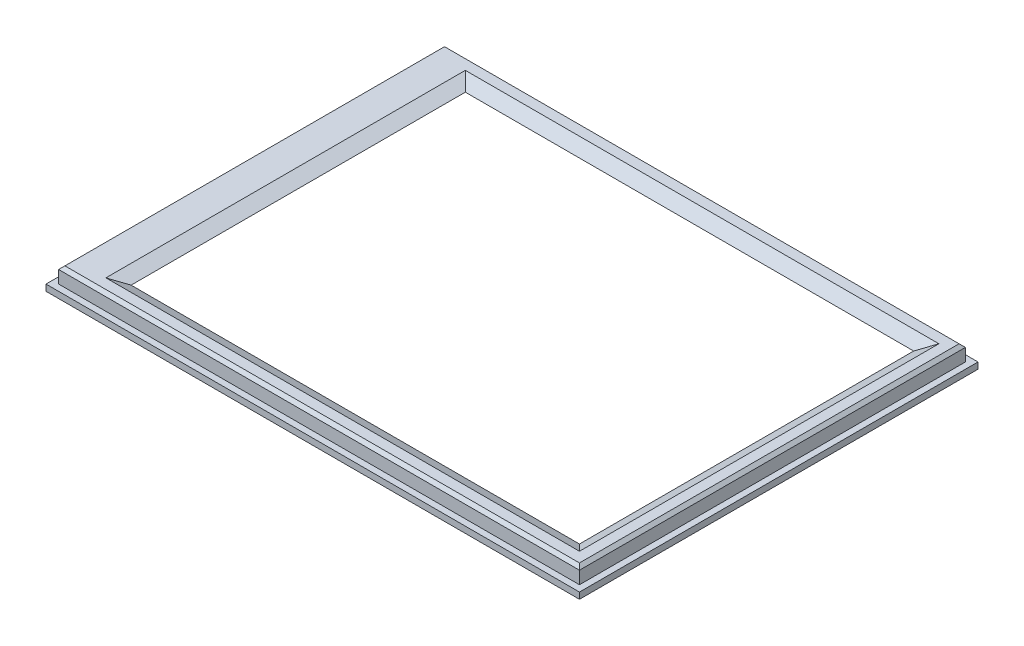
ISO-10303-21;
HEADER;
FILE_DESCRIPTION(('STEP AP214'),'2;1');
FILE_NAME('part.step','',(''),(''),'','','');
FILE_SCHEMA(('AUTOMOTIVE_DESIGN { 1 0 10303 214 1 1 1 1 }'));
ENDSEC;
DATA;
#1=APPLICATION_CONTEXT('core data for automotive mechanical design processes');
#2=APPLICATION_PROTOCOL_DEFINITION('international standard','automotive_design',2000,#1);
#3=PRODUCT_CONTEXT('',#1,'mechanical');
#4=PRODUCT('Part','Part','',(#3));
#5=PRODUCT_RELATED_PRODUCT_CATEGORY('part','',(#4));
#6=PRODUCT_DEFINITION_FORMATION('','',#4);
#7=PRODUCT_DEFINITION_CONTEXT('part definition',#1,'design');
#8=PRODUCT_DEFINITION('design','',#6,#7);
#9=PRODUCT_DEFINITION_SHAPE('','',#8);
#10=(LENGTH_UNIT() NAMED_UNIT(*) SI_UNIT(.MILLI.,.METRE.));
#11=(NAMED_UNIT(*) PLANE_ANGLE_UNIT() SI_UNIT($,.RADIAN.));
#12=(NAMED_UNIT(*) SI_UNIT($,.STERADIAN.) SOLID_ANGLE_UNIT());
#13=UNCERTAINTY_MEASURE_WITH_UNIT(LENGTH_MEASURE(1.E-05),#10,'distance_accuracy_value','');
#14=(GEOMETRIC_REPRESENTATION_CONTEXT(3) GLOBAL_UNCERTAINTY_ASSIGNED_CONTEXT((#13)) GLOBAL_UNIT_ASSIGNED_CONTEXT((#10,
#11,#12)) REPRESENTATION_CONTEXT('',''));
#15=CARTESIAN_POINT('',(0.,0.,0.));
#16=DIRECTION('',(0.,0.,1.));
#17=DIRECTION('',(1.,0.,0.));
#18=AXIS2_PLACEMENT_3D('',#15,#16,#17);
#19=CARTESIAN_POINT('',(2.,1.,-2.));
#20=DIRECTION('',(1.,0.,0.));
#21=DIRECTION('',(0.,0.,-1.));
#22=AXIS2_PLACEMENT_3D('',#19,#20,#21);
#23=PLANE('',#22);
#24=DIRECTION('',(0.,-1.,0.));
#25=VECTOR('',#24,1.);
#26=CARTESIAN_POINT('',(2.,1.,-61.2));
#27=LINE('',#26,#25);
#28=CARTESIAN_POINT('',(2.,2.5,-61.2));
#29=VERTEX_POINT('',#28);
#30=CARTESIAN_POINT('',(2.,0.,-61.2));
#31=VERTEX_POINT('',#30);
#32=EDGE_CURVE('E230',#29,#31,#27,.T.);
#33=ORIENTED_EDGE('',*,*,#32,.F.);
#34=DIRECTION('',(0.,0.,1.));
#35=VECTOR('',#34,1.);
#36=CARTESIAN_POINT('',(2.,2.5,-2.));
#37=LINE('',#36,#35);
#38=CARTESIAN_POINT('',(2.,2.5,-2.));
#39=VERTEX_POINT('',#38);
#40=EDGE_CURVE('E195',#29,#39,#37,.T.);
#41=ORIENTED_EDGE('',*,*,#40,.T.);
#42=DIRECTION('',(0.,-1.,0.));
#43=VECTOR('',#42,1.);
#44=CARTESIAN_POINT('',(2.,1.,-2.));
#45=LINE('',#44,#43);
#46=CARTESIAN_POINT('',(2.,0.,-2.));
#47=VERTEX_POINT('',#46);
#48=EDGE_CURVE('E236',#39,#47,#45,.T.);
#49=ORIENTED_EDGE('',*,*,#48,.T.);
#50=DIRECTION('',(0.,0.,1.));
#51=VECTOR('',#50,1.);
#52=CARTESIAN_POINT('',(2.,0.,-2.));
#53=LINE('',#52,#51);
#54=EDGE_CURVE('E218',#31,#47,#53,.T.);
#55=ORIENTED_EDGE('',*,*,#54,.F.);
#56=EDGE_LOOP('',(#33,#41,#49,#55));
#57=FACE_BOUND('',#56,.T.);
#58=ADVANCED_FACE('F32',(#57),#23,.T.);
#59=CARTESIAN_POINT('',(2.,1.,-2.));
#60=DIRECTION('',(0.,0.,-1.));
#61=DIRECTION('',(-1.,0.,0.));
#62=AXIS2_PLACEMENT_3D('',#59,#60,#61);
#63=PLANE('',#62);
#64=ORIENTED_EDGE('',*,*,#48,.F.);
#65=DIRECTION('',(1.,0.,0.));
#66=VECTOR('',#65,1.);
#67=CARTESIAN_POINT('',(2.,2.5,-2.));
#68=LINE('',#67,#66);
#69=CARTESIAN_POINT('',(82.6,2.5,-2.));
#70=VERTEX_POINT('',#69);
#71=EDGE_CURVE('E192',#39,#70,#68,.T.);
#72=ORIENTED_EDGE('',*,*,#71,.T.);
#73=DIRECTION('',(0.,-1.,0.));
#74=VECTOR('',#73,1.);
#75=CARTESIAN_POINT('',(82.6,1.,-2.));
#76=LINE('',#75,#74);
#77=CARTESIAN_POINT('',(82.6,0.,-2.));
#78=VERTEX_POINT('',#77);
#79=EDGE_CURVE('E234',#70,#78,#76,.T.);
#80=ORIENTED_EDGE('',*,*,#79,.T.);
#81=DIRECTION('',(1.,0.,0.));
#82=VECTOR('',#81,1.);
#83=CARTESIAN_POINT('',(2.,0.,-2.));
#84=LINE('',#83,#82);
#85=EDGE_CURVE('E221',#47,#78,#84,.T.);
#86=ORIENTED_EDGE('',*,*,#85,.F.);
#87=EDGE_LOOP('',(#64,#72,#80,#86));
#88=FACE_BOUND('',#87,.T.);
#89=ADVANCED_FACE('F348',(#88),#63,.T.);
#90=CARTESIAN_POINT('',(82.6,1.,-2.));
#91=DIRECTION('',(-1.,0.,0.));
#92=DIRECTION('',(0.,0.,1.));
#93=AXIS2_PLACEMENT_3D('',#90,#91,#92);
#94=PLANE('',#93);
#95=ORIENTED_EDGE('',*,*,#79,.F.);
#96=DIRECTION('',(0.,0.,-1.));
#97=VECTOR('',#96,1.);
#98=CARTESIAN_POINT('',(82.6,2.5,-2.));
#99=LINE('',#98,#97);
#100=CARTESIAN_POINT('',(82.6,2.5,-61.2));
#101=VERTEX_POINT('',#100);
#102=EDGE_CURVE('E189',#70,#101,#99,.T.);
#103=ORIENTED_EDGE('',*,*,#102,.T.);
#104=DIRECTION('',(0.,-1.,0.));
#105=VECTOR('',#104,1.);
#106=CARTESIAN_POINT('',(82.6,1.,-61.2));
#107=LINE('',#106,#105);
#108=CARTESIAN_POINT('',(82.6,0.,-61.2));
#109=VERTEX_POINT('',#108);
#110=EDGE_CURVE('E232',#101,#109,#107,.T.);
#111=ORIENTED_EDGE('',*,*,#110,.T.);
#112=DIRECTION('',(0.,0.,-1.));
#113=VECTOR('',#112,1.);
#114=CARTESIAN_POINT('',(82.6,0.,-2.));
#115=LINE('',#114,#113);
#116=EDGE_CURVE('E224',#78,#109,#115,.T.);
#117=ORIENTED_EDGE('',*,*,#116,.F.);
#118=EDGE_LOOP('',(#95,#103,#111,#117));
#119=FACE_BOUND('',#118,.T.);
#120=ADVANCED_FACE('F354',(#119),#94,.T.);
#121=CARTESIAN_POINT('',(2.,1.,-61.2));
#122=DIRECTION('',(0.,0.,1.));
#123=DIRECTION('',(1.,0.,0.));
#124=AXIS2_PLACEMENT_3D('',#121,#122,#123);
#125=PLANE('',#124);
#126=ORIENTED_EDGE('',*,*,#110,.F.);
#127=DIRECTION('',(-1.,0.,0.));
#128=VECTOR('',#127,1.);
#129=CARTESIAN_POINT('',(2.,2.5,-61.2));
#130=LINE('',#129,#128);
#131=EDGE_CURVE('E186',#101,#29,#130,.T.);
#132=ORIENTED_EDGE('',*,*,#131,.T.);
#133=ORIENTED_EDGE('',*,*,#32,.T.);
#134=DIRECTION('',(-1.,0.,0.));
#135=VECTOR('',#134,1.);
#136=CARTESIAN_POINT('',(2.,0.,-61.2));
#137=LINE('',#136,#135);
#138=EDGE_CURVE('E227',#109,#31,#137,.T.);
#139=ORIENTED_EDGE('',*,*,#138,.F.);
#140=EDGE_LOOP('',(#126,#132,#133,#139));
#141=FACE_BOUND('',#140,.T.);
#142=ADVANCED_FACE('F364',(#141),#125,.T.);
#143=CARTESIAN_POINT('',(0.,1.,0.));
#144=DIRECTION('',(0.,-1.,0.));
#145=DIRECTION('',(0.,0.,-1.));
#146=AXIS2_PLACEMENT_3D('',#143,#144,#145);
#147=PLANE('',#146);
#148=DIRECTION('',(0.,0.,1.));
#149=VECTOR('',#148,1.);
#150=CARTESIAN_POINT('',(0.,1.,0.));
#151=LINE('',#150,#149);
#152=CARTESIAN_POINT('',(0.,1.,-63.2));
#153=VERTEX_POINT('',#152);
#154=CARTESIAN_POINT('',(0.,1.,0.));
#155=VERTEX_POINT('',#154);
#156=EDGE_CURVE('E239',#153,#155,#151,.T.);
#157=ORIENTED_EDGE('',*,*,#156,.T.);
#158=DIRECTION('',(1.,0.,0.));
#159=VECTOR('',#158,1.);
#160=CARTESIAN_POINT('',(0.,1.,0.));
#161=LINE('',#160,#159);
#162=CARTESIAN_POINT('',(84.6,1.,0.));
#163=VERTEX_POINT('',#162);
#164=EDGE_CURVE('E242',#155,#163,#161,.T.);
#165=ORIENTED_EDGE('',*,*,#164,.T.);
#166=DIRECTION('',(0.,0.,-1.));
#167=VECTOR('',#166,1.);
#168=CARTESIAN_POINT('',(84.6,1.,0.));
#169=LINE('',#168,#167);
#170=CARTESIAN_POINT('',(84.6,1.,-63.2));
#171=VERTEX_POINT('',#170);
#172=EDGE_CURVE('E245',#163,#171,#169,.T.);
#173=ORIENTED_EDGE('',*,*,#172,.T.);
#174=DIRECTION('',(-1.,0.,0.));
#175=VECTOR('',#174,1.);
#176=CARTESIAN_POINT('',(0.,1.,-63.2));
#177=LINE('',#176,#175);
#178=EDGE_CURVE('E247',#171,#153,#177,.T.);
#179=ORIENTED_EDGE('',*,*,#178,.T.);
#180=EDGE_LOOP('',(#157,#165,#173,#179));
#181=FACE_BOUND('',#180,.T.);
#182=DIRECTION('',(0.,0.,1.));
#183=VECTOR('',#182,1.);
#184=CARTESIAN_POINT('',(1.,1.,-62.2));
#185=LINE('',#184,#183);
#186=CARTESIAN_POINT('',(1.,1.,-62.2));
#187=VERTEX_POINT('',#186);
#188=CARTESIAN_POINT('',(1.,1.,-1.));
#189=VERTEX_POINT('',#188);
#190=EDGE_CURVE('E198',#187,#189,#185,.T.);
#191=ORIENTED_EDGE('',*,*,#190,.F.);
#192=DIRECTION('',(-1.,0.,0.));
#193=VECTOR('',#192,1.);
#194=CARTESIAN_POINT('',(1.,1.,-62.2));
#195=LINE('',#194,#193);
#196=CARTESIAN_POINT('',(83.6,1.,-62.2));
#197=VERTEX_POINT('',#196);
#198=EDGE_CURVE('E207',#197,#187,#195,.T.);
#199=ORIENTED_EDGE('',*,*,#198,.F.);
#200=DIRECTION('',(0.,0.,-1.));
#201=VECTOR('',#200,1.);
#202=CARTESIAN_POINT('',(83.6,1.,-62.2));
#203=LINE('',#202,#201);
#204=CARTESIAN_POINT('',(83.6,1.,-1.));
#205=VERTEX_POINT('',#204);
#206=EDGE_CURVE('E204',#205,#197,#203,.T.);
#207=ORIENTED_EDGE('',*,*,#206,.F.);
#208=DIRECTION('',(1.,0.,0.));
#209=VECTOR('',#208,1.);
#210=CARTESIAN_POINT('',(1.,1.,-1.));
#211=LINE('',#210,#209);
#212=EDGE_CURVE('E201',#189,#205,#211,.T.);
#213=ORIENTED_EDGE('',*,*,#212,.F.);
#214=EDGE_LOOP('',(#191,#199,#207,#213));
#215=FACE_BOUND('',#214,.T.);
#216=ADVANCED_FACE('F360',(#181,#215),#147,.F.);
#217=CARTESIAN_POINT('',(0.,0.,0.));
#218=DIRECTION('',(0.,-1.,0.));
#219=DIRECTION('',(0.,0.,-1.));
#220=AXIS2_PLACEMENT_3D('',#217,#218,#219);
#221=PLANE('',#220);
#222=DIRECTION('',(0.,0.,1.));
#223=VECTOR('',#222,1.);
#224=CARTESIAN_POINT('',(0.,0.,0.));
#225=LINE('',#224,#223);
#226=CARTESIAN_POINT('',(0.,0.,-63.2));
#227=VERTEX_POINT('',#226);
#228=CARTESIAN_POINT('',(0.,0.,0.));
#229=VERTEX_POINT('',#228);
#230=EDGE_CURVE('E238',#227,#229,#225,.T.);
#231=ORIENTED_EDGE('',*,*,#230,.F.);
#232=DIRECTION('',(-1.,0.,0.));
#233=VECTOR('',#232,1.);
#234=CARTESIAN_POINT('',(0.,0.,-63.2));
#235=LINE('',#234,#233);
#236=CARTESIAN_POINT('',(84.6,0.,-63.2));
#237=VERTEX_POINT('',#236);
#238=EDGE_CURVE('E243',#237,#227,#235,.T.);
#239=ORIENTED_EDGE('',*,*,#238,.F.);
#240=DIRECTION('',(0.,0.,-1.));
#241=VECTOR('',#240,1.);
#242=CARTESIAN_POINT('',(84.6,0.,0.));
#243=LINE('',#242,#241);
#244=CARTESIAN_POINT('',(84.6,0.,0.));
#245=VERTEX_POINT('',#244);
#246=EDGE_CURVE('E254',#245,#237,#243,.T.);
#247=ORIENTED_EDGE('',*,*,#246,.F.);
#248=DIRECTION('',(1.,0.,0.));
#249=VECTOR('',#248,1.);
#250=CARTESIAN_POINT('',(0.,0.,0.));
#251=LINE('',#250,#249);
#252=EDGE_CURVE('E252',#229,#245,#251,.T.);
#253=ORIENTED_EDGE('',*,*,#252,.F.);
#254=EDGE_LOOP('',(#231,#239,#247,#253));
#255=FACE_BOUND('',#254,.T.);
#256=ORIENTED_EDGE('',*,*,#138,.T.);
#257=ORIENTED_EDGE('',*,*,#54,.T.);
#258=ORIENTED_EDGE('',*,*,#85,.T.);
#259=ORIENTED_EDGE('',*,*,#116,.T.);
#260=EDGE_LOOP('',(#256,#257,#258,#259));
#261=FACE_BOUND('',#260,.T.);
#262=ADVANCED_FACE('F363',(#255,#261),#221,.T.);
#263=CARTESIAN_POINT('',(0.,1.,0.));
#264=DIRECTION('',(1.,0.,0.));
#265=DIRECTION('',(0.,0.,-1.));
#266=AXIS2_PLACEMENT_3D('',#263,#264,#265);
#267=PLANE('',#266);
#268=ORIENTED_EDGE('',*,*,#230,.T.);
#269=DIRECTION('',(0.,-1.,0.));
#270=VECTOR('',#269,1.);
#271=CARTESIAN_POINT('',(0.,1.,0.));
#272=LINE('',#271,#270);
#273=EDGE_CURVE('E265',#155,#229,#272,.T.);
#274=ORIENTED_EDGE('',*,*,#273,.F.);
#275=ORIENTED_EDGE('',*,*,#156,.F.);
#276=DIRECTION('',(0.,-1.,0.));
#277=VECTOR('',#276,1.);
#278=CARTESIAN_POINT('',(0.,1.,-63.2));
#279=LINE('',#278,#277);
#280=EDGE_CURVE('E249',#153,#227,#279,.T.);
#281=ORIENTED_EDGE('',*,*,#280,.T.);
#282=EDGE_LOOP('',(#268,#274,#275,#281));
#283=FACE_BOUND('',#282,.T.);
#284=ADVANCED_FACE('F368',(#283),#267,.F.);
#285=CARTESIAN_POINT('',(0.,1.,0.));
#286=DIRECTION('',(0.,0.,-1.));
#287=DIRECTION('',(-1.,0.,0.));
#288=AXIS2_PLACEMENT_3D('',#285,#286,#287);
#289=PLANE('',#288);
#290=ORIENTED_EDGE('',*,*,#252,.T.);
#291=DIRECTION('',(0.,-1.,0.));
#292=VECTOR('',#291,1.);
#293=CARTESIAN_POINT('',(84.6,1.,0.));
#294=LINE('',#293,#292);
#295=EDGE_CURVE('E262',#163,#245,#294,.T.);
#296=ORIENTED_EDGE('',*,*,#295,.F.);
#297=ORIENTED_EDGE('',*,*,#164,.F.);
#298=ORIENTED_EDGE('',*,*,#273,.T.);
#299=EDGE_LOOP('',(#290,#296,#297,#298));
#300=FACE_BOUND('',#299,.T.);
#301=ADVANCED_FACE('F376',(#300),#289,.F.);
#302=CARTESIAN_POINT('',(84.6,1.,0.));
#303=DIRECTION('',(-1.,0.,0.));
#304=DIRECTION('',(0.,0.,1.));
#305=AXIS2_PLACEMENT_3D('',#302,#303,#304);
#306=PLANE('',#305);
#307=ORIENTED_EDGE('',*,*,#246,.T.);
#308=DIRECTION('',(0.,-1.,0.));
#309=VECTOR('',#308,1.);
#310=CARTESIAN_POINT('',(84.6,1.,-63.2));
#311=LINE('',#310,#309);
#312=EDGE_CURVE('E259',#171,#237,#311,.T.);
#313=ORIENTED_EDGE('',*,*,#312,.F.);
#314=ORIENTED_EDGE('',*,*,#172,.F.);
#315=ORIENTED_EDGE('',*,*,#295,.T.);
#316=EDGE_LOOP('',(#307,#313,#314,#315));
#317=FACE_BOUND('',#316,.T.);
#318=ADVANCED_FACE('F372',(#317),#306,.F.);
#319=CARTESIAN_POINT('',(0.,1.,-63.2));
#320=DIRECTION('',(0.,0.,1.));
#321=DIRECTION('',(1.,0.,0.));
#322=AXIS2_PLACEMENT_3D('',#319,#320,#321);
#323=PLANE('',#322);
#324=ORIENTED_EDGE('',*,*,#238,.T.);
#325=ORIENTED_EDGE('',*,*,#280,.F.);
#326=ORIENTED_EDGE('',*,*,#178,.F.);
#327=ORIENTED_EDGE('',*,*,#312,.T.);
#328=EDGE_LOOP('',(#324,#325,#326,#327));
#329=FACE_BOUND('',#328,.T.);
#330=ADVANCED_FACE('F330',(#329),#323,.F.);
#331=CARTESIAN_POINT('',(0.,3.5,0.));
#332=DIRECTION('',(0.,1.,0.));
#333=DIRECTION('',(0.,0.,1.));
#334=AXIS2_PLACEMENT_3D('',#331,#332,#333);
#335=PLANE('',#334);
#336=DIRECTION('',(0.,0.,1.));
#337=VECTOR('',#336,1.);
#338=CARTESIAN_POINT('',(1.5,3.5,-1.));
#339=LINE('',#338,#337);
#340=CARTESIAN_POINT('',(1.5,3.5,-61.7));
#341=VERTEX_POINT('',#340);
#342=CARTESIAN_POINT('',(1.5,3.5,-1.5));
#343=VERTEX_POINT('',#342);
#344=EDGE_CURVE('E276',#341,#343,#339,.T.);
#345=ORIENTED_EDGE('',*,*,#344,.T.);
#346=DIRECTION('',(1.,0.,0.));
#347=VECTOR('',#346,1.);
#348=CARTESIAN_POINT('',(83.6,3.5,-1.5));
#349=LINE('',#348,#347);
#350=CARTESIAN_POINT('',(83.1,3.5,-1.5));
#351=VERTEX_POINT('',#350);
#352=EDGE_CURVE('E286',#343,#351,#349,.T.);
#353=ORIENTED_EDGE('',*,*,#352,.T.);
#354=DIRECTION('',(0.,0.,-1.));
#355=VECTOR('',#354,1.);
#356=CARTESIAN_POINT('',(83.1,3.5,-62.2));
#357=LINE('',#356,#355);
#358=CARTESIAN_POINT('',(83.1,3.5,-61.7));
#359=VERTEX_POINT('',#358);
#360=EDGE_CURVE('E284',#351,#359,#357,.T.);
#361=ORIENTED_EDGE('',*,*,#360,.T.);
#362=DIRECTION('',(-1.,0.,0.));
#363=VECTOR('',#362,1.);
#364=CARTESIAN_POINT('',(1.,3.5,-61.7));
#365=LINE('',#364,#363);
#366=EDGE_CURVE('E282',#359,#341,#365,.T.);
#367=ORIENTED_EDGE('',*,*,#366,.T.);
#368=EDGE_LOOP('',(#345,#353,#361,#367));
#369=FACE_BOUND('',#368,.T.);
#370=DIRECTION('',(1.,0.,0.));
#371=VECTOR('',#370,1.);
#372=CARTESIAN_POINT('',(79.5,3.5,-60.1));
#373=LINE('',#372,#371);
#374=CARTESIAN_POINT('',(6.39999999999999,3.5,-60.1));
#375=VERTEX_POINT('',#374);
#376=CARTESIAN_POINT('',(81.5,3.5,-60.1));
#377=VERTEX_POINT('',#376);
#378=EDGE_CURVE('E268',#375,#377,#373,.T.);
#379=ORIENTED_EDGE('',*,*,#378,.T.);
#380=DIRECTION('',(0.,0.,1.));
#381=VECTOR('',#380,1.);
#382=CARTESIAN_POINT('',(81.5,3.5,-5.10000000000001));
#383=LINE('',#382,#381);
#384=CARTESIAN_POINT('',(81.5,3.5,-3.09999999999999));
#385=VERTEX_POINT('',#384);
#386=EDGE_CURVE('E273',#377,#385,#383,.T.);
#387=ORIENTED_EDGE('',*,*,#386,.T.);
#388=DIRECTION('',(-1.,0.,0.));
#389=VECTOR('',#388,1.);
#390=CARTESIAN_POINT('',(8.40000000000001,3.5,-3.09999999999999));
#391=LINE('',#390,#389);
#392=CARTESIAN_POINT('',(6.39999999999999,3.5,-3.09999999999999));
#393=VERTEX_POINT('',#392);
#394=EDGE_CURVE('E271',#385,#393,#391,.T.);
#395=ORIENTED_EDGE('',*,*,#394,.T.);
#396=DIRECTION('',(0.,0.,-1.));
#397=VECTOR('',#396,1.);
#398=CARTESIAN_POINT('',(6.39999999999999,3.5,-58.1));
#399=LINE('',#398,#397);
#400=EDGE_CURVE('E173',#393,#375,#399,.T.);
#401=ORIENTED_EDGE('',*,*,#400,.T.);
#402=EDGE_LOOP('',(#379,#387,#395,#401));
#403=FACE_BOUND('',#402,.T.);
#404=ADVANCED_FACE('F326',(#369,#403),#335,.T.);
#405=CARTESIAN_POINT('',(1.,3.5,-62.2));
#406=DIRECTION('',(1.,0.,0.));
#407=DIRECTION('',(0.,0.,-1.));
#408=AXIS2_PLACEMENT_3D('',#405,#406,#407);
#409=PLANE('',#408);
#410=DIRECTION('',(0.,-1.,0.));
#411=VECTOR('',#410,1.);
#412=CARTESIAN_POINT('',(1.,3.5,-1.));
#413=LINE('',#412,#411);
#414=CARTESIAN_POINT('',(1.,3.,-1.));
#415=VERTEX_POINT('',#414);
#416=EDGE_CURVE('E216',#415,#189,#413,.T.);
#417=ORIENTED_EDGE('',*,*,#416,.F.);
#418=DIRECTION('',(0.,0.,-1.));
#419=VECTOR('',#418,1.);
#420=CARTESIAN_POINT('',(1.,3.,-62.2));
#421=LINE('',#420,#419);
#422=CARTESIAN_POINT('',(1.,3.,-62.2));
#423=VERTEX_POINT('',#422);
#424=EDGE_CURVE('E11',#415,#423,#421,.T.);
#425=ORIENTED_EDGE('',*,*,#424,.T.);
#426=DIRECTION('',(0.,-1.,0.));
#427=VECTOR('',#426,1.);
#428=CARTESIAN_POINT('',(1.,3.5,-62.2));
#429=LINE('',#428,#427);
#430=EDGE_CURVE('E210',#423,#187,#429,.T.);
#431=ORIENTED_EDGE('',*,*,#430,.T.);
#432=ORIENTED_EDGE('',*,*,#190,.T.);
#433=EDGE_LOOP('',(#417,#425,#431,#432));
#434=FACE_BOUND('',#433,.T.);
#435=ADVANCED_FACE('F329',(#434),#409,.F.);
#436=CARTESIAN_POINT('',(1.,3.5,-1.));
#437=DIRECTION('',(0.,0.,-1.));
#438=DIRECTION('',(-1.,0.,0.));
#439=AXIS2_PLACEMENT_3D('',#436,#437,#438);
#440=PLANE('',#439);
#441=DIRECTION('',(0.,-1.,0.));
#442=VECTOR('',#441,1.);
#443=CARTESIAN_POINT('',(83.6,3.5,-1.));
#444=LINE('',#443,#442);
#445=CARTESIAN_POINT('',(83.6,3.,-1.));
#446=VERTEX_POINT('',#445);
#447=EDGE_CURVE('E214',#446,#205,#444,.T.);
#448=ORIENTED_EDGE('',*,*,#447,.F.);
#449=DIRECTION('',(-1.,0.,0.));
#450=VECTOR('',#449,1.);
#451=CARTESIAN_POINT('',(1.,3.,-1.));
#452=LINE('',#451,#450);
#453=EDGE_CURVE('E289',#446,#415,#452,.T.);
#454=ORIENTED_EDGE('',*,*,#453,.T.);
#455=ORIENTED_EDGE('',*,*,#416,.T.);
#456=ORIENTED_EDGE('',*,*,#212,.T.);
#457=EDGE_LOOP('',(#448,#454,#455,#456));
#458=FACE_BOUND('',#457,.T.);
#459=ADVANCED_FACE('F320',(#458),#440,.F.);
#460=CARTESIAN_POINT('',(83.6,3.5,-62.2));
#461=DIRECTION('',(-1.,0.,0.));
#462=DIRECTION('',(0.,0.,1.));
#463=AXIS2_PLACEMENT_3D('',#460,#461,#462);
#464=PLANE('',#463);
#465=DIRECTION('',(0.,-1.,0.));
#466=VECTOR('',#465,1.);
#467=CARTESIAN_POINT('',(83.6,3.5,-62.2));
#468=LINE('',#467,#466);
#469=CARTESIAN_POINT('',(83.6,3.,-62.2));
#470=VERTEX_POINT('',#469);
#471=EDGE_CURVE('E212',#470,#197,#468,.T.);
#472=ORIENTED_EDGE('',*,*,#471,.F.);
#473=DIRECTION('',(0.,0.,1.));
#474=VECTOR('',#473,1.);
#475=CARTESIAN_POINT('',(83.6,3.,-1.));
#476=LINE('',#475,#474);
#477=EDGE_CURVE('E292',#470,#446,#476,.T.);
#478=ORIENTED_EDGE('',*,*,#477,.T.);
#479=ORIENTED_EDGE('',*,*,#447,.T.);
#480=ORIENTED_EDGE('',*,*,#206,.T.);
#481=EDGE_LOOP('',(#472,#478,#479,#480));
#482=FACE_BOUND('',#481,.T.);
#483=ADVANCED_FACE('F316',(#482),#464,.F.);
#484=CARTESIAN_POINT('',(1.,3.5,-62.2));
#485=DIRECTION('',(0.,0.,1.));
#486=DIRECTION('',(1.,0.,0.));
#487=AXIS2_PLACEMENT_3D('',#484,#485,#486);
#488=PLANE('',#487);
#489=ORIENTED_EDGE('',*,*,#430,.F.);
#490=DIRECTION('',(1.,0.,0.));
#491=VECTOR('',#490,1.);
#492=CARTESIAN_POINT('',(83.6,3.,-62.2));
#493=LINE('',#492,#491);
#494=EDGE_CURVE('E41',#423,#470,#493,.T.);
#495=ORIENTED_EDGE('',*,*,#494,.T.);
#496=ORIENTED_EDGE('',*,*,#471,.T.);
#497=ORIENTED_EDGE('',*,*,#198,.T.);
#498=EDGE_LOOP('',(#489,#495,#496,#497));
#499=FACE_BOUND('',#498,.T.);
#500=ADVANCED_FACE('F399',(#499),#488,.F.);
#501=CARTESIAN_POINT('',(0.,2.5,0.));
#502=DIRECTION('',(0.,1.,0.));
#503=DIRECTION('',(0.,0.,1.));
#504=AXIS2_PLACEMENT_3D('',#501,#502,#503);
#505=PLANE('',#504);
#506=ORIENTED_EDGE('',*,*,#40,.F.);
#507=ORIENTED_EDGE('',*,*,#131,.F.);
#508=ORIENTED_EDGE('',*,*,#102,.F.);
#509=ORIENTED_EDGE('',*,*,#71,.F.);
#510=EDGE_LOOP('',(#506,#507,#508,#509));
#511=FACE_BOUND('',#510,.T.);
#512=DIRECTION('',(-1.,0.,0.));
#513=VECTOR('',#512,1.);
#514=CARTESIAN_POINT('',(8.4,2.5,-58.1));
#515=LINE('',#514,#513);
#516=CARTESIAN_POINT('',(79.5,2.5,-58.1));
#517=VERTEX_POINT('',#516);
#518=CARTESIAN_POINT('',(8.4,2.5,-58.1));
#519=VERTEX_POINT('',#518);
#520=EDGE_CURVE('E164',#517,#519,#515,.T.);
#521=ORIENTED_EDGE('',*,*,#520,.T.);
#522=DIRECTION('',(0.,0.,1.));
#523=VECTOR('',#522,1.);
#524=CARTESIAN_POINT('',(8.4,2.5,-58.1));
#525=LINE('',#524,#523);
#526=CARTESIAN_POINT('',(8.40000000000001,2.5,-5.10000000000001));
#527=VERTEX_POINT('',#526);
#528=EDGE_CURVE('E156',#519,#527,#525,.T.);
#529=ORIENTED_EDGE('',*,*,#528,.T.);
#530=DIRECTION('',(1.,0.,0.));
#531=VECTOR('',#530,1.);
#532=CARTESIAN_POINT('',(8.40000000000001,2.5,-5.10000000000001));
#533=LINE('',#532,#531);
#534=CARTESIAN_POINT('',(79.5,2.5,-5.1));
#535=VERTEX_POINT('',#534);
#536=EDGE_CURVE('E161',#527,#535,#533,.T.);
#537=ORIENTED_EDGE('',*,*,#536,.T.);
#538=DIRECTION('',(0.,0.,-1.));
#539=VECTOR('',#538,1.);
#540=CARTESIAN_POINT('',(79.5,2.5,-58.1));
#541=LINE('',#540,#539);
#542=EDGE_CURVE('E181',#535,#517,#541,.T.);
#543=ORIENTED_EDGE('',*,*,#542,.T.);
#544=EDGE_LOOP('',(#521,#529,#537,#543));
#545=FACE_BOUND('',#544,.T.);
#546=ADVANCED_FACE('F158',(#511,#545),#505,.F.);
#547=CARTESIAN_POINT('',(8.4,2.5,-58.1));
#548=DIRECTION('',(0.447213595499955,0.894427190999917,0.));
#549=DIRECTION('',(0.,0.,-1.));
#550=AXIS2_PLACEMENT_3D('',#547,#548,#549);
#551=PLANE('',#550);
#552=DIRECTION('',(0.666666666666667,-0.333333333333331,0.666666666666667));
#553=VECTOR('',#552,1.);
#554=CARTESIAN_POINT('',(8.4,2.5,-58.1));
#555=LINE('',#554,#553);
#556=EDGE_CURVE('E176',#375,#519,#555,.T.);
#557=ORIENTED_EDGE('',*,*,#556,.F.);
#558=ORIENTED_EDGE('',*,*,#400,.F.);
#559=DIRECTION('',(0.666666666666667,-0.333333333333331,-0.666666666666667));
#560=VECTOR('',#559,1.);
#561=CARTESIAN_POINT('',(8.40000000000001,2.5,-5.10000000000001));
#562=LINE('',#561,#560);
#563=EDGE_CURVE('E168',#527,#393,#562,.F.);
#564=ORIENTED_EDGE('',*,*,#563,.F.);
#565=ORIENTED_EDGE('',*,*,#528,.F.);
#566=EDGE_LOOP('',(#557,#558,#564,#565));
#567=FACE_BOUND('',#566,.T.);
#568=ADVANCED_FACE('F172',(#567),#551,.T.);
#569=CARTESIAN_POINT('',(8.40000000000001,2.5,-5.10000000000001));
#570=DIRECTION('',(0.,0.894427190999917,-0.447213595499955));
#571=DIRECTION('',(-1.,0.,0.));
#572=AXIS2_PLACEMENT_3D('',#569,#570,#571);
#573=PLANE('',#572);
#574=ORIENTED_EDGE('',*,*,#563,.T.);
#575=ORIENTED_EDGE('',*,*,#394,.F.);
#576=DIRECTION('',(-0.666666666666667,-0.333333333333331,-0.666666666666667));
#577=VECTOR('',#576,1.);
#578=CARTESIAN_POINT('',(55.9444444444444,-9.27777777777773,-28.6555555555556));
#579=LINE('',#578,#577);
#580=EDGE_CURVE('E179',#535,#385,#579,.F.);
#581=ORIENTED_EDGE('',*,*,#580,.F.);
#582=ORIENTED_EDGE('',*,*,#536,.F.);
#583=EDGE_LOOP('',(#574,#575,#581,#582));
#584=FACE_BOUND('',#583,.T.);
#585=ADVANCED_FACE('F178',(#584),#573,.T.);
#586=CARTESIAN_POINT('',(8.4,2.5,-58.1));
#587=DIRECTION('',(0.,0.894427190999917,0.447213595499955));
#588=DIRECTION('',(1.,0.,0.));
#589=AXIS2_PLACEMENT_3D('',#586,#587,#588);
#590=PLANE('',#589);
#591=ORIENTED_EDGE('',*,*,#556,.T.);
#592=ORIENTED_EDGE('',*,*,#520,.F.);
#593=DIRECTION('',(0.666666666666667,0.333333333333332,-0.666666666666668));
#594=VECTOR('',#593,1.);
#595=CARTESIAN_POINT('',(79.5,2.5,-58.1));
#596=LINE('',#595,#594);
#597=EDGE_CURVE('E277',#377,#517,#596,.F.);
#598=ORIENTED_EDGE('',*,*,#597,.F.);
#599=ORIENTED_EDGE('',*,*,#378,.F.);
#600=EDGE_LOOP('',(#591,#592,#598,#599));
#601=FACE_BOUND('',#600,.T.);
#602=ADVANCED_FACE('F338',(#601),#590,.T.);
#603=CARTESIAN_POINT('',(79.5,2.5,-58.1));
#604=DIRECTION('',(-0.447213595499956,0.894427190999917,0.));
#605=DIRECTION('',(0.,0.,1.));
#606=AXIS2_PLACEMENT_3D('',#603,#604,#605);
#607=PLANE('',#606);
#608=ORIENTED_EDGE('',*,*,#580,.T.);
#609=ORIENTED_EDGE('',*,*,#386,.F.);
#610=ORIENTED_EDGE('',*,*,#597,.T.);
#611=ORIENTED_EDGE('',*,*,#542,.F.);
#612=EDGE_LOOP('',(#608,#609,#610,#611));
#613=FACE_BOUND('',#612,.T.);
#614=ADVANCED_FACE('F337',(#613),#607,.T.);
#615=CARTESIAN_POINT('',(0.,3.5,-61.7));
#616=DIRECTION('',(0.,0.707106781186547,-0.707106781186547));
#617=DIRECTION('',(1.,0.,0.));
#618=AXIS2_PLACEMENT_3D('',#615,#616,#617);
#619=PLANE('',#618);
#620=DIRECTION('',(0.577350269189626,-0.577350269189626,-0.577350269189626));
#621=VECTOR('',#620,1.);
#622=CARTESIAN_POINT('',(55.4,31.2,-34.));
#623=LINE('',#622,#621);
#624=EDGE_CURVE('E298',#470,#359,#623,.F.);
#625=ORIENTED_EDGE('',*,*,#624,.F.);
#626=ORIENTED_EDGE('',*,*,#494,.F.);
#627=DIRECTION('',(-0.577350269189626,-0.577350269189626,-0.577350269189626));
#628=VECTOR('',#627,1.);
#629=CARTESIAN_POINT('',(22.0666666666667,24.0666666666667,-41.1333333333333));
#630=LINE('',#629,#628);
#631=EDGE_CURVE('E36',#341,#423,#630,.T.);
#632=ORIENTED_EDGE('',*,*,#631,.F.);
#633=ORIENTED_EDGE('',*,*,#366,.F.);
#634=EDGE_LOOP('',(#625,#626,#632,#633));
#635=FACE_BOUND('',#634,.T.);
#636=ADVANCED_FACE('F34',(#635),#619,.T.);
#637=CARTESIAN_POINT('',(1.5,3.5,0.));
#638=DIRECTION('',(-0.707106781186547,0.707106781186548,0.));
#639=DIRECTION('',(0.,0.,-1.));
#640=AXIS2_PLACEMENT_3D('',#637,#638,#639);
#641=PLANE('',#640);
#642=ORIENTED_EDGE('',*,*,#631,.T.);
#643=ORIENTED_EDGE('',*,*,#424,.F.);
#644=DIRECTION('',(0.577350269189626,0.577350269189626,-0.577350269189626));
#645=VECTOR('',#644,1.);
#646=CARTESIAN_POINT('',(1.,3.,-1.));
#647=LINE('',#646,#645);
#648=EDGE_CURVE('E297',#343,#415,#647,.F.);
#649=ORIENTED_EDGE('',*,*,#648,.F.);
#650=ORIENTED_EDGE('',*,*,#344,.F.);
#651=EDGE_LOOP('',(#642,#643,#649,#650));
#652=FACE_BOUND('',#651,.T.);
#653=ADVANCED_FACE('F308',(#652),#641,.T.);
#654=CARTESIAN_POINT('',(83.1,3.5,0.));
#655=DIRECTION('',(0.707106781186547,0.707106781186548,0.));
#656=DIRECTION('',(0.,0.,1.));
#657=AXIS2_PLACEMENT_3D('',#654,#655,#656);
#658=PLANE('',#657);
#659=ORIENTED_EDGE('',*,*,#624,.T.);
#660=ORIENTED_EDGE('',*,*,#360,.F.);
#661=DIRECTION('',(0.577350269189626,-0.577350269189626,0.577350269189626));
#662=VECTOR('',#661,1.);
#663=CARTESIAN_POINT('',(83.6,3.00000000000001,-1.00000000000001));
#664=LINE('',#663,#662);
#665=EDGE_CURVE('E295',#446,#351,#664,.F.);
#666=ORIENTED_EDGE('',*,*,#665,.F.);
#667=ORIENTED_EDGE('',*,*,#477,.F.);
#668=EDGE_LOOP('',(#659,#660,#666,#667));
#669=FACE_BOUND('',#668,.T.);
#670=ADVANCED_FACE('F313',(#669),#658,.T.);
#671=CARTESIAN_POINT('',(0.,3.5,-1.5));
#672=DIRECTION('',(0.,0.707106781186547,0.707106781186547));
#673=DIRECTION('',(-1.,0.,0.));
#674=AXIS2_PLACEMENT_3D('',#671,#672,#673);
#675=PLANE('',#674);
#676=ORIENTED_EDGE('',*,*,#648,.T.);
#677=ORIENTED_EDGE('',*,*,#453,.F.);
#678=ORIENTED_EDGE('',*,*,#665,.T.);
#679=ORIENTED_EDGE('',*,*,#352,.F.);
#680=EDGE_LOOP('',(#676,#677,#678,#679));
#681=FACE_BOUND('',#680,.T.);
#682=ADVANCED_FACE('F323',(#681),#675,.T.);
#683=CLOSED_SHELL('',(#58,#89,#120,#142,#216,#262,#284,#301,#318,#330,#404,#435,#459,#483,#500,
#546,#568,#585,#602,#614,#636,#653,#670,#682));
#684=MANIFOLD_SOLID_BREP('B2',#683);
#685=ADVANCED_BREP_SHAPE_REPRESENTATION('',(#18,#684),#14);
#686=SHAPE_DEFINITION_REPRESENTATION(#9,#685);
ENDSEC;
END-ISO-10303-21;
